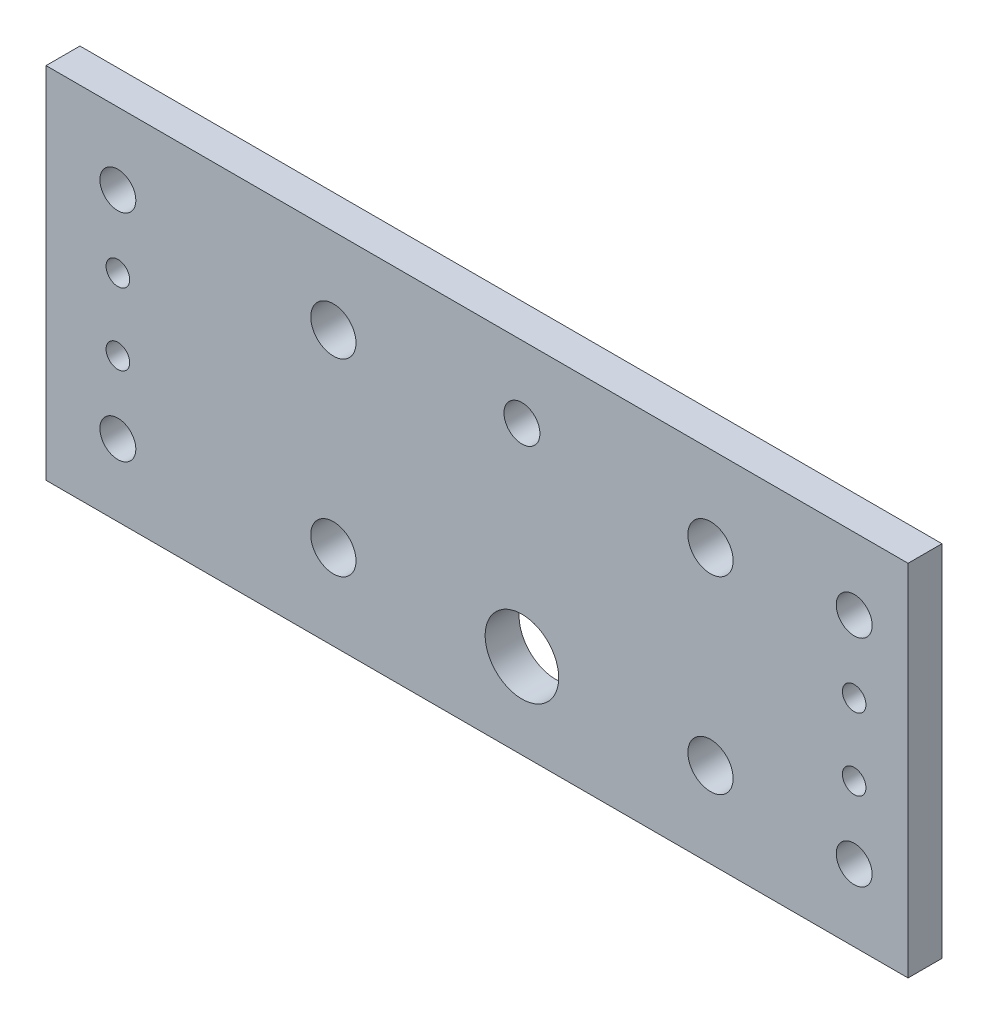
ISO-10303-21;
HEADER;
FILE_DESCRIPTION(('STEP AP214'),'2;1');
FILE_NAME('part.step','',(''),(''),'','','');
FILE_SCHEMA(('AUTOMOTIVE_DESIGN { 1 0 10303 214 1 1 1 1 }'));
ENDSEC;
DATA;
#1=APPLICATION_CONTEXT('core data for automotive mechanical design processes');
#2=APPLICATION_PROTOCOL_DEFINITION('international standard','automotive_design',2000,#1);
#3=PRODUCT_CONTEXT('',#1,'mechanical');
#4=PRODUCT('Part','Part','',(#3));
#5=PRODUCT_RELATED_PRODUCT_CATEGORY('part','',(#4));
#6=PRODUCT_DEFINITION_FORMATION('','',#4);
#7=PRODUCT_DEFINITION_CONTEXT('part definition',#1,'design');
#8=PRODUCT_DEFINITION('design','',#6,#7);
#9=PRODUCT_DEFINITION_SHAPE('','',#8);
#10=(LENGTH_UNIT() NAMED_UNIT(*) SI_UNIT(.MILLI.,.METRE.));
#11=(NAMED_UNIT(*) PLANE_ANGLE_UNIT() SI_UNIT($,.RADIAN.));
#12=(NAMED_UNIT(*) SI_UNIT($,.STERADIAN.) SOLID_ANGLE_UNIT());
#13=UNCERTAINTY_MEASURE_WITH_UNIT(LENGTH_MEASURE(1.E-05),#10,'distance_accuracy_value','');
#14=(GEOMETRIC_REPRESENTATION_CONTEXT(3) GLOBAL_UNCERTAINTY_ASSIGNED_CONTEXT((#13)) GLOBAL_UNIT_ASSIGNED_CONTEXT((#10,
#11,#12)) REPRESENTATION_CONTEXT('',''));
#15=CARTESIAN_POINT('',(0.,0.,0.));
#16=DIRECTION('',(0.,0.,1.));
#17=DIRECTION('',(1.,0.,0.));
#18=AXIS2_PLACEMENT_3D('',#15,#16,#17);
#19=CARTESIAN_POINT('',(0.,0.,5.9944));
#20=DIRECTION('',(0.,0.,-1.));
#21=DIRECTION('',(-1.,0.,0.));
#22=AXIS2_PLACEMENT_3D('',#19,#20,#21);
#23=PLANE('',#22);
#24=CARTESIAN_POINT('',(142.875,12.7,5.9944));
#25=DIRECTION('',(0.,0.,1.));
#26=DIRECTION('',(1.,0.,0.));
#27=AXIS2_PLACEMENT_3D('',#24,#25,#26);
#28=CIRCLE('',#27,3.175);
#29=CARTESIAN_POINT('',(146.05,12.7,5.9944));
#30=VERTEX_POINT('',#29);
#31=EDGE_CURVE('E183',#30,#30,#28,.T.);
#32=ORIENTED_EDGE('',*,*,#31,.F.);
#33=EDGE_LOOP('',(#32));
#34=FACE_BOUND('',#33,.T.);
#35=CARTESIAN_POINT('',(50.8,15.0749,5.9944));
#36=DIRECTION('',(0.,0.,1.));
#37=DIRECTION('',(1.,0.,0.));
#38=AXIS2_PLACEMENT_3D('',#35,#36,#37);
#39=CIRCLE('',#38,3.99999999999999);
#40=CARTESIAN_POINT('',(54.8,15.0749,5.9944));
#41=VERTEX_POINT('',#40);
#42=EDGE_CURVE('E171',#41,#41,#39,.T.);
#43=ORIENTED_EDGE('',*,*,#42,.F.);
#44=EDGE_LOOP('',(#43));
#45=FACE_BOUND('',#44,.T.);
#46=CARTESIAN_POINT('',(117.475,48.4251,5.9944));
#47=DIRECTION('',(0.,0.,1.));
#48=DIRECTION('',(1.,0.,0.));
#49=AXIS2_PLACEMENT_3D('',#46,#47,#48);
#50=CIRCLE('',#49,4.00000000000002);
#51=CARTESIAN_POINT('',(121.475,48.4251,5.9944));
#52=VERTEX_POINT('',#51);
#53=EDGE_CURVE('E159',#52,#52,#50,.T.);
#54=ORIENTED_EDGE('',*,*,#53,.F.);
#55=EDGE_LOOP('',(#54));
#56=FACE_BOUND('',#55,.T.);
#57=CARTESIAN_POINT('',(12.7,12.7,5.9944));
#58=DIRECTION('',(0.,0.,1.));
#59=DIRECTION('',(1.,0.,0.));
#60=AXIS2_PLACEMENT_3D('',#57,#58,#59);
#61=CIRCLE('',#60,3.175);
#62=CARTESIAN_POINT('',(15.875,12.7,5.9944));
#63=VERTEX_POINT('',#62);
#64=EDGE_CURVE('E147',#63,#63,#61,.T.);
#65=ORIENTED_EDGE('',*,*,#64,.F.);
#66=EDGE_LOOP('',(#65));
#67=FACE_BOUND('',#66,.T.);
#68=CARTESIAN_POINT('',(142.875,38.1,5.9944));
#69=DIRECTION('',(0.,0.,1.));
#70=DIRECTION('',(1.,0.,0.));
#71=AXIS2_PLACEMENT_3D('',#68,#69,#70);
#72=CIRCLE('',#71,2.08279999999999);
#73=CARTESIAN_POINT('',(144.9578,38.1,5.9944));
#74=VERTEX_POINT('',#73);
#75=EDGE_CURVE('E135',#74,#74,#72,.T.);
#76=ORIENTED_EDGE('',*,*,#75,.F.);
#77=EDGE_LOOP('',(#76));
#78=FACE_BOUND('',#77,.T.);
#79=CARTESIAN_POINT('',(12.7,38.1,5.9944));
#80=DIRECTION('',(0.,0.,1.));
#81=DIRECTION('',(1.,0.,0.));
#82=AXIS2_PLACEMENT_3D('',#79,#80,#81);
#83=CIRCLE('',#82,2.0828);
#84=CARTESIAN_POINT('',(14.7828,38.1,5.9944));
#85=VERTEX_POINT('',#84);
#86=EDGE_CURVE('E123',#85,#85,#83,.T.);
#87=ORIENTED_EDGE('',*,*,#86,.F.);
#88=EDGE_LOOP('',(#87));
#89=FACE_BOUND('',#88,.T.);
#90=CARTESIAN_POINT('',(84.1375,15.0749,5.9944));
#91=DIRECTION('',(0.,0.,1.));
#92=DIRECTION('',(1.,0.,0.));
#93=AXIS2_PLACEMENT_3D('',#90,#91,#92);
#94=CIRCLE('',#93,6.5);
#95=CARTESIAN_POINT('',(90.6375,15.0749,5.9944));
#96=VERTEX_POINT('',#95);
#97=EDGE_CURVE('E102',#96,#96,#94,.T.);
#98=ORIENTED_EDGE('',*,*,#97,.F.);
#99=EDGE_LOOP('',(#98));
#100=FACE_BOUND('',#99,.T.);
#101=DIRECTION('',(0.,-1.,0.));
#102=VECTOR('',#101,1.);
#103=CARTESIAN_POINT('',(0.,0.,5.9944));
#104=LINE('',#103,#102);
#105=CARTESIAN_POINT('',(0.,63.5,5.9944));
#106=VERTEX_POINT('',#105);
#107=CARTESIAN_POINT('',(0.,0.,5.9944));
#108=VERTEX_POINT('',#107);
#109=EDGE_CURVE('E87',#106,#108,#104,.T.);
#110=ORIENTED_EDGE('',*,*,#109,.T.);
#111=DIRECTION('',(1.,0.,0.));
#112=VECTOR('',#111,1.);
#113=CARTESIAN_POINT('',(0.,0.,5.9944));
#114=LINE('',#113,#112);
#115=CARTESIAN_POINT('',(152.4,0.,5.9944));
#116=VERTEX_POINT('',#115);
#117=EDGE_CURVE('E82',#108,#116,#114,.T.);
#118=ORIENTED_EDGE('',*,*,#117,.T.);
#119=DIRECTION('',(0.,1.,0.));
#120=VECTOR('',#119,1.);
#121=CARTESIAN_POINT('',(152.4,0.,5.9944));
#122=LINE('',#121,#120);
#123=CARTESIAN_POINT('',(152.4,63.5,5.9944));
#124=VERTEX_POINT('',#123);
#125=EDGE_CURVE('E85',#116,#124,#122,.T.);
#126=ORIENTED_EDGE('',*,*,#125,.T.);
#127=DIRECTION('',(-1.,0.,0.));
#128=VECTOR('',#127,1.);
#129=CARTESIAN_POINT('',(0.,63.5,5.9944));
#130=LINE('',#129,#128);
#131=EDGE_CURVE('E52',#124,#106,#130,.T.);
#132=ORIENTED_EDGE('',*,*,#131,.T.);
#133=EDGE_LOOP('',(#110,#118,#126,#132));
#134=FACE_BOUND('',#133,.T.);
#135=CARTESIAN_POINT('',(12.7,50.8,5.9944));
#136=DIRECTION('',(0.,0.,1.));
#137=DIRECTION('',(1.,0.,0.));
#138=AXIS2_PLACEMENT_3D('',#135,#136,#137);
#139=CIRCLE('',#138,3.175);
#140=CARTESIAN_POINT('',(15.875,50.8,5.9944));
#141=VERTEX_POINT('',#140);
#142=EDGE_CURVE('E117',#141,#141,#139,.T.);
#143=ORIENTED_EDGE('',*,*,#142,.F.);
#144=EDGE_LOOP('',(#143));
#145=FACE_BOUND('',#144,.T.);
#146=CARTESIAN_POINT('',(12.7,25.4,5.9944));
#147=DIRECTION('',(0.,0.,1.));
#148=DIRECTION('',(1.,0.,0.));
#149=AXIS2_PLACEMENT_3D('',#146,#147,#148);
#150=CIRCLE('',#149,2.0828);
#151=CARTESIAN_POINT('',(14.7828,25.4,5.9944));
#152=VERTEX_POINT('',#151);
#153=EDGE_CURVE('E129',#152,#152,#150,.T.);
#154=ORIENTED_EDGE('',*,*,#153,.F.);
#155=EDGE_LOOP('',(#154));
#156=FACE_BOUND('',#155,.T.);
#157=CARTESIAN_POINT('',(142.875,25.4,5.9944));
#158=DIRECTION('',(0.,0.,1.));
#159=DIRECTION('',(1.,0.,0.));
#160=AXIS2_PLACEMENT_3D('',#157,#158,#159);
#161=CIRCLE('',#160,2.08279999999999);
#162=CARTESIAN_POINT('',(144.9578,25.4,5.9944));
#163=VERTEX_POINT('',#162);
#164=EDGE_CURVE('E141',#163,#163,#161,.T.);
#165=ORIENTED_EDGE('',*,*,#164,.F.);
#166=EDGE_LOOP('',(#165));
#167=FACE_BOUND('',#166,.T.);
#168=CARTESIAN_POINT('',(50.8,48.4251,5.9944));
#169=DIRECTION('',(0.,0.,1.));
#170=DIRECTION('',(1.,0.,0.));
#171=AXIS2_PLACEMENT_3D('',#168,#169,#170);
#172=CIRCLE('',#171,4.00000000000003);
#173=CARTESIAN_POINT('',(54.8,48.4251,5.9944));
#174=VERTEX_POINT('',#173);
#175=EDGE_CURVE('E153',#174,#174,#172,.T.);
#176=ORIENTED_EDGE('',*,*,#175,.F.);
#177=EDGE_LOOP('',(#176));
#178=FACE_BOUND('',#177,.T.);
#179=CARTESIAN_POINT('',(117.475,15.0749,5.9944));
#180=DIRECTION('',(0.,0.,1.));
#181=DIRECTION('',(1.,0.,0.));
#182=AXIS2_PLACEMENT_3D('',#179,#180,#181);
#183=CIRCLE('',#182,4.00000000000002);
#184=CARTESIAN_POINT('',(121.475,15.0749,5.9944));
#185=VERTEX_POINT('',#184);
#186=EDGE_CURVE('E165',#185,#185,#183,.T.);
#187=ORIENTED_EDGE('',*,*,#186,.F.);
#188=EDGE_LOOP('',(#187));
#189=FACE_BOUND('',#188,.T.);
#190=CARTESIAN_POINT('',(142.875,50.8,5.9944));
#191=DIRECTION('',(0.,0.,1.));
#192=DIRECTION('',(1.,0.,0.));
#193=AXIS2_PLACEMENT_3D('',#190,#191,#192);
#194=CIRCLE('',#193,3.175);
#195=CARTESIAN_POINT('',(146.05,50.8,5.9944));
#196=VERTEX_POINT('',#195);
#197=EDGE_CURVE('E177',#196,#196,#194,.T.);
#198=ORIENTED_EDGE('',*,*,#197,.F.);
#199=EDGE_LOOP('',(#198));
#200=FACE_BOUND('',#199,.T.);
#201=CARTESIAN_POINT('',(84.1375,50.8,5.9944));
#202=DIRECTION('',(0.,0.,1.));
#203=DIRECTION('',(1.,0.,0.));
#204=AXIS2_PLACEMENT_3D('',#201,#202,#203);
#205=CIRCLE('',#204,3.175);
#206=CARTESIAN_POINT('',(87.3125,50.8,5.9944));
#207=VERTEX_POINT('',#206);
#208=EDGE_CURVE('E189',#207,#207,#205,.T.);
#209=ORIENTED_EDGE('',*,*,#208,.F.);
#210=EDGE_LOOP('',(#209));
#211=FACE_BOUND('',#210,.T.);
#212=ADVANCED_FACE('F35',(#34,#45,#56,#67,#78,#89,#100,#134,#145,#156,#167,#178,#189,#200,#211),
#23,.F.);
#213=CARTESIAN_POINT('',(0.,0.,0.));
#214=DIRECTION('',(0.,0.,-1.));
#215=DIRECTION('',(-1.,0.,0.));
#216=AXIS2_PLACEMENT_3D('',#213,#214,#215);
#217=PLANE('',#216);
#218=CARTESIAN_POINT('',(142.875,12.7,0.));
#219=DIRECTION('',(0.,0.,1.));
#220=DIRECTION('',(1.,0.,0.));
#221=AXIS2_PLACEMENT_3D('',#218,#219,#220);
#222=CIRCLE('',#221,3.175);
#223=CARTESIAN_POINT('',(146.05,12.7,0.));
#224=VERTEX_POINT('',#223);
#225=EDGE_CURVE('E186',#224,#224,#222,.T.);
#226=ORIENTED_EDGE('',*,*,#225,.T.);
#227=EDGE_LOOP('',(#226));
#228=FACE_BOUND('',#227,.T.);
#229=CARTESIAN_POINT('',(50.8,15.0749,0.));
#230=DIRECTION('',(0.,0.,1.));
#231=DIRECTION('',(1.,0.,0.));
#232=AXIS2_PLACEMENT_3D('',#229,#230,#231);
#233=CIRCLE('',#232,3.99999999999999);
#234=CARTESIAN_POINT('',(54.8,15.0749,0.));
#235=VERTEX_POINT('',#234);
#236=EDGE_CURVE('E174',#235,#235,#233,.T.);
#237=ORIENTED_EDGE('',*,*,#236,.T.);
#238=EDGE_LOOP('',(#237));
#239=FACE_BOUND('',#238,.T.);
#240=CARTESIAN_POINT('',(117.475,48.4251,0.));
#241=DIRECTION('',(0.,0.,1.));
#242=DIRECTION('',(1.,0.,0.));
#243=AXIS2_PLACEMENT_3D('',#240,#241,#242);
#244=CIRCLE('',#243,4.00000000000002);
#245=CARTESIAN_POINT('',(121.475,48.4251,0.));
#246=VERTEX_POINT('',#245);
#247=EDGE_CURVE('E162',#246,#246,#244,.T.);
#248=ORIENTED_EDGE('',*,*,#247,.T.);
#249=EDGE_LOOP('',(#248));
#250=FACE_BOUND('',#249,.T.);
#251=CARTESIAN_POINT('',(12.7,12.7,0.));
#252=DIRECTION('',(0.,0.,1.));
#253=DIRECTION('',(1.,0.,0.));
#254=AXIS2_PLACEMENT_3D('',#251,#252,#253);
#255=CIRCLE('',#254,3.175);
#256=CARTESIAN_POINT('',(15.875,12.7,0.));
#257=VERTEX_POINT('',#256);
#258=EDGE_CURVE('E150',#257,#257,#255,.T.);
#259=ORIENTED_EDGE('',*,*,#258,.T.);
#260=EDGE_LOOP('',(#259));
#261=FACE_BOUND('',#260,.T.);
#262=CARTESIAN_POINT('',(142.875,38.1,0.));
#263=DIRECTION('',(0.,0.,1.));
#264=DIRECTION('',(1.,0.,0.));
#265=AXIS2_PLACEMENT_3D('',#262,#263,#264);
#266=CIRCLE('',#265,2.08279999999999);
#267=CARTESIAN_POINT('',(144.9578,38.1,0.));
#268=VERTEX_POINT('',#267);
#269=EDGE_CURVE('E138',#268,#268,#266,.T.);
#270=ORIENTED_EDGE('',*,*,#269,.T.);
#271=EDGE_LOOP('',(#270));
#272=FACE_BOUND('',#271,.T.);
#273=CARTESIAN_POINT('',(12.7,38.1,0.));
#274=DIRECTION('',(0.,0.,1.));
#275=DIRECTION('',(1.,0.,0.));
#276=AXIS2_PLACEMENT_3D('',#273,#274,#275);
#277=CIRCLE('',#276,2.0828);
#278=CARTESIAN_POINT('',(14.7828,38.1,0.));
#279=VERTEX_POINT('',#278);
#280=EDGE_CURVE('E126',#279,#279,#277,.T.);
#281=ORIENTED_EDGE('',*,*,#280,.T.);
#282=EDGE_LOOP('',(#281));
#283=FACE_BOUND('',#282,.T.);
#284=CARTESIAN_POINT('',(84.1375,15.0749,0.));
#285=DIRECTION('',(0.,0.,1.));
#286=DIRECTION('',(1.,0.,0.));
#287=AXIS2_PLACEMENT_3D('',#284,#285,#286);
#288=CIRCLE('',#287,6.5);
#289=CARTESIAN_POINT('',(90.6375,15.0749,0.));
#290=VERTEX_POINT('',#289);
#291=EDGE_CURVE('E114',#290,#290,#288,.T.);
#292=ORIENTED_EDGE('',*,*,#291,.T.);
#293=EDGE_LOOP('',(#292));
#294=FACE_BOUND('',#293,.T.);
#295=DIRECTION('',(0.,-1.,0.));
#296=VECTOR('',#295,1.);
#297=CARTESIAN_POINT('',(0.,0.,0.));
#298=LINE('',#297,#296);
#299=CARTESIAN_POINT('',(0.,63.5,0.));
#300=VERTEX_POINT('',#299);
#301=CARTESIAN_POINT('',(0.,0.,0.));
#302=VERTEX_POINT('',#301);
#303=EDGE_CURVE('E99',#300,#302,#298,.T.);
#304=ORIENTED_EDGE('',*,*,#303,.F.);
#305=DIRECTION('',(-1.,0.,0.));
#306=VECTOR('',#305,1.);
#307=CARTESIAN_POINT('',(0.,63.5,0.));
#308=LINE('',#307,#306);
#309=CARTESIAN_POINT('',(152.4,63.5,0.));
#310=VERTEX_POINT('',#309);
#311=EDGE_CURVE('E75',#310,#300,#308,.T.);
#312=ORIENTED_EDGE('',*,*,#311,.F.);
#313=DIRECTION('',(0.,1.,0.));
#314=VECTOR('',#313,1.);
#315=CARTESIAN_POINT('',(152.4,0.,0.));
#316=LINE('',#315,#314);
#317=CARTESIAN_POINT('',(152.4,0.,0.));
#318=VERTEX_POINT('',#317);
#319=EDGE_CURVE('E69',#318,#310,#316,.T.);
#320=ORIENTED_EDGE('',*,*,#319,.F.);
#321=DIRECTION('',(1.,0.,0.));
#322=VECTOR('',#321,1.);
#323=CARTESIAN_POINT('',(0.,0.,0.));
#324=LINE('',#323,#322);
#325=EDGE_CURVE('E91',#302,#318,#324,.T.);
#326=ORIENTED_EDGE('',*,*,#325,.F.);
#327=EDGE_LOOP('',(#304,#312,#320,#326));
#328=FACE_BOUND('',#327,.T.);
#329=CARTESIAN_POINT('',(12.7,50.8,0.));
#330=DIRECTION('',(0.,0.,1.));
#331=DIRECTION('',(1.,0.,0.));
#332=AXIS2_PLACEMENT_3D('',#329,#330,#331);
#333=CIRCLE('',#332,3.175);
#334=CARTESIAN_POINT('',(15.875,50.8,0.));
#335=VERTEX_POINT('',#334);
#336=EDGE_CURVE('E120',#335,#335,#333,.T.);
#337=ORIENTED_EDGE('',*,*,#336,.T.);
#338=EDGE_LOOP('',(#337));
#339=FACE_BOUND('',#338,.T.);
#340=CARTESIAN_POINT('',(12.7,25.4,0.));
#341=DIRECTION('',(0.,0.,1.));
#342=DIRECTION('',(1.,0.,0.));
#343=AXIS2_PLACEMENT_3D('',#340,#341,#342);
#344=CIRCLE('',#343,2.0828);
#345=CARTESIAN_POINT('',(14.7828,25.4,0.));
#346=VERTEX_POINT('',#345);
#347=EDGE_CURVE('E132',#346,#346,#344,.T.);
#348=ORIENTED_EDGE('',*,*,#347,.T.);
#349=EDGE_LOOP('',(#348));
#350=FACE_BOUND('',#349,.T.);
#351=CARTESIAN_POINT('',(142.875,25.4,0.));
#352=DIRECTION('',(0.,0.,1.));
#353=DIRECTION('',(1.,0.,0.));
#354=AXIS2_PLACEMENT_3D('',#351,#352,#353);
#355=CIRCLE('',#354,2.08279999999999);
#356=CARTESIAN_POINT('',(144.9578,25.4,0.));
#357=VERTEX_POINT('',#356);
#358=EDGE_CURVE('E144',#357,#357,#355,.T.);
#359=ORIENTED_EDGE('',*,*,#358,.T.);
#360=EDGE_LOOP('',(#359));
#361=FACE_BOUND('',#360,.T.);
#362=CARTESIAN_POINT('',(50.8,48.4251,0.));
#363=DIRECTION('',(0.,0.,1.));
#364=DIRECTION('',(1.,0.,0.));
#365=AXIS2_PLACEMENT_3D('',#362,#363,#364);
#366=CIRCLE('',#365,4.00000000000003);
#367=CARTESIAN_POINT('',(54.8,48.4251,0.));
#368=VERTEX_POINT('',#367);
#369=EDGE_CURVE('E156',#368,#368,#366,.T.);
#370=ORIENTED_EDGE('',*,*,#369,.T.);
#371=EDGE_LOOP('',(#370));
#372=FACE_BOUND('',#371,.T.);
#373=CARTESIAN_POINT('',(117.475,15.0749,0.));
#374=DIRECTION('',(0.,0.,1.));
#375=DIRECTION('',(1.,0.,0.));
#376=AXIS2_PLACEMENT_3D('',#373,#374,#375);
#377=CIRCLE('',#376,4.00000000000002);
#378=CARTESIAN_POINT('',(121.475,15.0749,0.));
#379=VERTEX_POINT('',#378);
#380=EDGE_CURVE('E168',#379,#379,#377,.T.);
#381=ORIENTED_EDGE('',*,*,#380,.T.);
#382=EDGE_LOOP('',(#381));
#383=FACE_BOUND('',#382,.T.);
#384=CARTESIAN_POINT('',(142.875,50.8,0.));
#385=DIRECTION('',(0.,0.,1.));
#386=DIRECTION('',(1.,0.,0.));
#387=AXIS2_PLACEMENT_3D('',#384,#385,#386);
#388=CIRCLE('',#387,3.175);
#389=CARTESIAN_POINT('',(146.05,50.8,0.));
#390=VERTEX_POINT('',#389);
#391=EDGE_CURVE('E180',#390,#390,#388,.T.);
#392=ORIENTED_EDGE('',*,*,#391,.T.);
#393=EDGE_LOOP('',(#392));
#394=FACE_BOUND('',#393,.T.);
#395=CARTESIAN_POINT('',(84.1375,50.8,0.));
#396=DIRECTION('',(0.,0.,1.));
#397=DIRECTION('',(1.,0.,0.));
#398=AXIS2_PLACEMENT_3D('',#395,#396,#397);
#399=CIRCLE('',#398,3.175);
#400=CARTESIAN_POINT('',(87.3125,50.8,0.));
#401=VERTEX_POINT('',#400);
#402=EDGE_CURVE('E192',#401,#401,#399,.T.);
#403=ORIENTED_EDGE('',*,*,#402,.T.);
#404=EDGE_LOOP('',(#403));
#405=FACE_BOUND('',#404,.T.);
#406=ADVANCED_FACE('F110',(#228,#239,#250,#261,#272,#283,#294,#328,#339,#350,#361,#372,#383,
#394,#405),#217,.T.);
#407=CARTESIAN_POINT('',(0.,0.,5.9944));
#408=DIRECTION('',(1.,0.,0.));
#409=DIRECTION('',(0.,0.,-1.));
#410=AXIS2_PLACEMENT_3D('',#407,#408,#409);
#411=PLANE('',#410);
#412=ORIENTED_EDGE('',*,*,#303,.T.);
#413=DIRECTION('',(0.,0.,-1.));
#414=VECTOR('',#413,1.);
#415=CARTESIAN_POINT('',(0.,0.,5.9944));
#416=LINE('',#415,#414);
#417=EDGE_CURVE('E11',#108,#302,#416,.T.);
#418=ORIENTED_EDGE('',*,*,#417,.F.);
#419=ORIENTED_EDGE('',*,*,#109,.F.);
#420=DIRECTION('',(0.,0.,-1.));
#421=VECTOR('',#420,1.);
#422=CARTESIAN_POINT('',(0.,63.5,5.9944));
#423=LINE('',#422,#421);
#424=EDGE_CURVE('E95',#106,#300,#423,.T.);
#425=ORIENTED_EDGE('',*,*,#424,.T.);
#426=EDGE_LOOP('',(#412,#418,#419,#425));
#427=FACE_BOUND('',#426,.T.);
#428=ADVANCED_FACE('F37',(#427),#411,.F.);
#429=CARTESIAN_POINT('',(0.,0.,5.9944));
#430=DIRECTION('',(0.,1.,0.));
#431=DIRECTION('',(0.,0.,1.));
#432=AXIS2_PLACEMENT_3D('',#429,#430,#431);
#433=PLANE('',#432);
#434=ORIENTED_EDGE('',*,*,#325,.T.);
#435=DIRECTION('',(0.,0.,-1.));
#436=VECTOR('',#435,1.);
#437=CARTESIAN_POINT('',(152.4,0.,5.9944));
#438=LINE('',#437,#436);
#439=EDGE_CURVE('E44',#116,#318,#438,.T.);
#440=ORIENTED_EDGE('',*,*,#439,.F.);
#441=ORIENTED_EDGE('',*,*,#117,.F.);
#442=ORIENTED_EDGE('',*,*,#417,.T.);
#443=EDGE_LOOP('',(#434,#440,#441,#442));
#444=FACE_BOUND('',#443,.T.);
#445=ADVANCED_FACE('F90',(#444),#433,.F.);
#446=CARTESIAN_POINT('',(152.4,0.,5.9944));
#447=DIRECTION('',(-1.,0.,0.));
#448=DIRECTION('',(0.,-1.,0.));
#449=AXIS2_PLACEMENT_3D('',#446,#447,#448);
#450=PLANE('',#449);
#451=ORIENTED_EDGE('',*,*,#319,.T.);
#452=DIRECTION('',(0.,0.,-1.));
#453=VECTOR('',#452,1.);
#454=CARTESIAN_POINT('',(152.4,63.5,5.9944));
#455=LINE('',#454,#453);
#456=EDGE_CURVE('E92',#124,#310,#455,.T.);
#457=ORIENTED_EDGE('',*,*,#456,.F.);
#458=ORIENTED_EDGE('',*,*,#125,.F.);
#459=ORIENTED_EDGE('',*,*,#439,.T.);
#460=EDGE_LOOP('',(#451,#457,#458,#459));
#461=FACE_BOUND('',#460,.T.);
#462=ADVANCED_FACE('F93',(#461),#450,.F.);
#463=CARTESIAN_POINT('',(0.,63.5,5.9944));
#464=DIRECTION('',(0.,-1.,0.));
#465=DIRECTION('',(0.,0.,-1.));
#466=AXIS2_PLACEMENT_3D('',#463,#464,#465);
#467=PLANE('',#466);
#468=ORIENTED_EDGE('',*,*,#311,.T.);
#469=ORIENTED_EDGE('',*,*,#424,.F.);
#470=ORIENTED_EDGE('',*,*,#131,.F.);
#471=ORIENTED_EDGE('',*,*,#456,.T.);
#472=EDGE_LOOP('',(#468,#469,#470,#471));
#473=FACE_BOUND('',#472,.T.);
#474=ADVANCED_FACE('F107',(#473),#467,.F.);
#475=CARTESIAN_POINT('',(84.1375,15.0749,5.9944));
#476=DIRECTION('',(0.,0.,-1.));
#477=DIRECTION('',(-1.,0.,0.));
#478=AXIS2_PLACEMENT_3D('',#475,#476,#477);
#479=CYLINDRICAL_SURFACE('',#478,6.5);
#480=ORIENTED_EDGE('',*,*,#97,.T.);
#481=EDGE_LOOP('',(#480));
#482=FACE_BOUND('',#481,.T.);
#483=ORIENTED_EDGE('',*,*,#291,.F.);
#484=EDGE_LOOP('',(#483));
#485=FACE_BOUND('',#484,.T.);
#486=ADVANCED_FACE('F212',(#482,#485),#479,.F.);
#487=CARTESIAN_POINT('',(12.7,50.8,5.9944));
#488=DIRECTION('',(0.,0.,-1.));
#489=DIRECTION('',(-1.,0.,0.));
#490=AXIS2_PLACEMENT_3D('',#487,#488,#489);
#491=CYLINDRICAL_SURFACE('',#490,3.175);
#492=ORIENTED_EDGE('',*,*,#142,.T.);
#493=EDGE_LOOP('',(#492));
#494=FACE_BOUND('',#493,.T.);
#495=ORIENTED_EDGE('',*,*,#336,.F.);
#496=EDGE_LOOP('',(#495));
#497=FACE_BOUND('',#496,.T.);
#498=ADVANCED_FACE('F258',(#494,#497),#491,.F.);
#499=CARTESIAN_POINT('',(12.7,38.1,5.9944));
#500=DIRECTION('',(0.,0.,-1.));
#501=DIRECTION('',(-1.,0.,0.));
#502=AXIS2_PLACEMENT_3D('',#499,#500,#501);
#503=CYLINDRICAL_SURFACE('',#502,2.0828);
#504=ORIENTED_EDGE('',*,*,#86,.T.);
#505=EDGE_LOOP('',(#504));
#506=FACE_BOUND('',#505,.T.);
#507=ORIENTED_EDGE('',*,*,#280,.F.);
#508=EDGE_LOOP('',(#507));
#509=FACE_BOUND('',#508,.T.);
#510=ADVANCED_FACE('F266',(#506,#509),#503,.F.);
#511=CARTESIAN_POINT('',(12.7,25.4,5.9944));
#512=DIRECTION('',(0.,0.,-1.));
#513=DIRECTION('',(-1.,0.,0.));
#514=AXIS2_PLACEMENT_3D('',#511,#512,#513);
#515=CYLINDRICAL_SURFACE('',#514,2.0828);
#516=ORIENTED_EDGE('',*,*,#153,.T.);
#517=EDGE_LOOP('',(#516));
#518=FACE_BOUND('',#517,.T.);
#519=ORIENTED_EDGE('',*,*,#347,.F.);
#520=EDGE_LOOP('',(#519));
#521=FACE_BOUND('',#520,.T.);
#522=ADVANCED_FACE('F274',(#518,#521),#515,.F.);
#523=CARTESIAN_POINT('',(142.875,38.1,5.9944));
#524=DIRECTION('',(0.,0.,-1.));
#525=DIRECTION('',(-1.,0.,0.));
#526=AXIS2_PLACEMENT_3D('',#523,#524,#525);
#527=CYLINDRICAL_SURFACE('',#526,2.08279999999999);
#528=ORIENTED_EDGE('',*,*,#75,.T.);
#529=EDGE_LOOP('',(#528));
#530=FACE_BOUND('',#529,.T.);
#531=ORIENTED_EDGE('',*,*,#269,.F.);
#532=EDGE_LOOP('',(#531));
#533=FACE_BOUND('',#532,.T.);
#534=ADVANCED_FACE('F283',(#530,#533),#527,.F.);
#535=CARTESIAN_POINT('',(142.875,25.4,5.9944));
#536=DIRECTION('',(0.,0.,-1.));
#537=DIRECTION('',(-1.,0.,0.));
#538=AXIS2_PLACEMENT_3D('',#535,#536,#537);
#539=CYLINDRICAL_SURFACE('',#538,2.08279999999999);
#540=ORIENTED_EDGE('',*,*,#164,.T.);
#541=EDGE_LOOP('',(#540));
#542=FACE_BOUND('',#541,.T.);
#543=ORIENTED_EDGE('',*,*,#358,.F.);
#544=EDGE_LOOP('',(#543));
#545=FACE_BOUND('',#544,.T.);
#546=ADVANCED_FACE('F292',(#542,#545),#539,.F.);
#547=CARTESIAN_POINT('',(12.7,12.7,5.9944));
#548=DIRECTION('',(0.,0.,-1.));
#549=DIRECTION('',(-1.,0.,0.));
#550=AXIS2_PLACEMENT_3D('',#547,#548,#549);
#551=CYLINDRICAL_SURFACE('',#550,3.175);
#552=ORIENTED_EDGE('',*,*,#64,.T.);
#553=EDGE_LOOP('',(#552));
#554=FACE_BOUND('',#553,.T.);
#555=ORIENTED_EDGE('',*,*,#258,.F.);
#556=EDGE_LOOP('',(#555));
#557=FACE_BOUND('',#556,.T.);
#558=ADVANCED_FACE('F301',(#554,#557),#551,.F.);
#559=CARTESIAN_POINT('',(50.8,48.4251,5.9944));
#560=DIRECTION('',(0.,0.,-1.));
#561=DIRECTION('',(-1.,0.,0.));
#562=AXIS2_PLACEMENT_3D('',#559,#560,#561);
#563=CYLINDRICAL_SURFACE('',#562,4.00000000000003);
#564=ORIENTED_EDGE('',*,*,#175,.T.);
#565=EDGE_LOOP('',(#564));
#566=FACE_BOUND('',#565,.T.);
#567=ORIENTED_EDGE('',*,*,#369,.F.);
#568=EDGE_LOOP('',(#567));
#569=FACE_BOUND('',#568,.T.);
#570=ADVANCED_FACE('F310',(#566,#569),#563,.F.);
#571=CARTESIAN_POINT('',(117.475,48.4251,5.9944));
#572=DIRECTION('',(0.,0.,-1.));
#573=DIRECTION('',(-1.,0.,0.));
#574=AXIS2_PLACEMENT_3D('',#571,#572,#573);
#575=CYLINDRICAL_SURFACE('',#574,4.00000000000002);
#576=ORIENTED_EDGE('',*,*,#53,.T.);
#577=EDGE_LOOP('',(#576));
#578=FACE_BOUND('',#577,.T.);
#579=ORIENTED_EDGE('',*,*,#247,.F.);
#580=EDGE_LOOP('',(#579));
#581=FACE_BOUND('',#580,.T.);
#582=ADVANCED_FACE('F319',(#578,#581),#575,.F.);
#583=CARTESIAN_POINT('',(117.475,15.0749,5.9944));
#584=DIRECTION('',(0.,0.,-1.));
#585=DIRECTION('',(-1.,0.,0.));
#586=AXIS2_PLACEMENT_3D('',#583,#584,#585);
#587=CYLINDRICAL_SURFACE('',#586,4.00000000000002);
#588=ORIENTED_EDGE('',*,*,#186,.T.);
#589=EDGE_LOOP('',(#588));
#590=FACE_BOUND('',#589,.T.);
#591=ORIENTED_EDGE('',*,*,#380,.F.);
#592=EDGE_LOOP('',(#591));
#593=FACE_BOUND('',#592,.T.);
#594=ADVANCED_FACE('F328',(#590,#593),#587,.F.);
#595=CARTESIAN_POINT('',(50.8,15.0749,5.9944));
#596=DIRECTION('',(0.,0.,-1.));
#597=DIRECTION('',(-1.,0.,0.));
#598=AXIS2_PLACEMENT_3D('',#595,#596,#597);
#599=CYLINDRICAL_SURFACE('',#598,3.99999999999999);
#600=ORIENTED_EDGE('',*,*,#42,.T.);
#601=EDGE_LOOP('',(#600));
#602=FACE_BOUND('',#601,.T.);
#603=ORIENTED_EDGE('',*,*,#236,.F.);
#604=EDGE_LOOP('',(#603));
#605=FACE_BOUND('',#604,.T.);
#606=ADVANCED_FACE('F337',(#602,#605),#599,.F.);
#607=CARTESIAN_POINT('',(142.875,50.8,5.9944));
#608=DIRECTION('',(0.,0.,-1.));
#609=DIRECTION('',(-1.,0.,0.));
#610=AXIS2_PLACEMENT_3D('',#607,#608,#609);
#611=CYLINDRICAL_SURFACE('',#610,3.175);
#612=ORIENTED_EDGE('',*,*,#197,.T.);
#613=EDGE_LOOP('',(#612));
#614=FACE_BOUND('',#613,.T.);
#615=ORIENTED_EDGE('',*,*,#391,.F.);
#616=EDGE_LOOP('',(#615));
#617=FACE_BOUND('',#616,.T.);
#618=ADVANCED_FACE('F346',(#614,#617),#611,.F.);
#619=CARTESIAN_POINT('',(142.875,12.7,5.9944));
#620=DIRECTION('',(0.,0.,-1.));
#621=DIRECTION('',(-1.,0.,0.));
#622=AXIS2_PLACEMENT_3D('',#619,#620,#621);
#623=CYLINDRICAL_SURFACE('',#622,3.175);
#624=ORIENTED_EDGE('',*,*,#31,.T.);
#625=EDGE_LOOP('',(#624));
#626=FACE_BOUND('',#625,.T.);
#627=ORIENTED_EDGE('',*,*,#225,.F.);
#628=EDGE_LOOP('',(#627));
#629=FACE_BOUND('',#628,.T.);
#630=ADVANCED_FACE('F355',(#626,#629),#623,.F.);
#631=CARTESIAN_POINT('',(84.1375,50.8,5.9944));
#632=DIRECTION('',(0.,0.,-1.));
#633=DIRECTION('',(-1.,0.,0.));
#634=AXIS2_PLACEMENT_3D('',#631,#632,#633);
#635=CYLINDRICAL_SURFACE('',#634,3.175);
#636=ORIENTED_EDGE('',*,*,#208,.T.);
#637=EDGE_LOOP('',(#636));
#638=FACE_BOUND('',#637,.T.);
#639=ORIENTED_EDGE('',*,*,#402,.F.);
#640=EDGE_LOOP('',(#639));
#641=FACE_BOUND('',#640,.T.);
#642=ADVANCED_FACE('F198',(#638,#641),#635,.F.);
#643=CLOSED_SHELL('',(#212,#406,#428,#445,#462,#474,#486,#498,#510,#522,#534,#546,#558,#570,
#582,#594,#606,#618,#630,#642));
#644=MANIFOLD_SOLID_BREP('B2',#643);
#645=ADVANCED_BREP_SHAPE_REPRESENTATION('',(#18,#644),#14);
#646=SHAPE_DEFINITION_REPRESENTATION(#9,#645);
ENDSEC;
END-ISO-10303-21;
